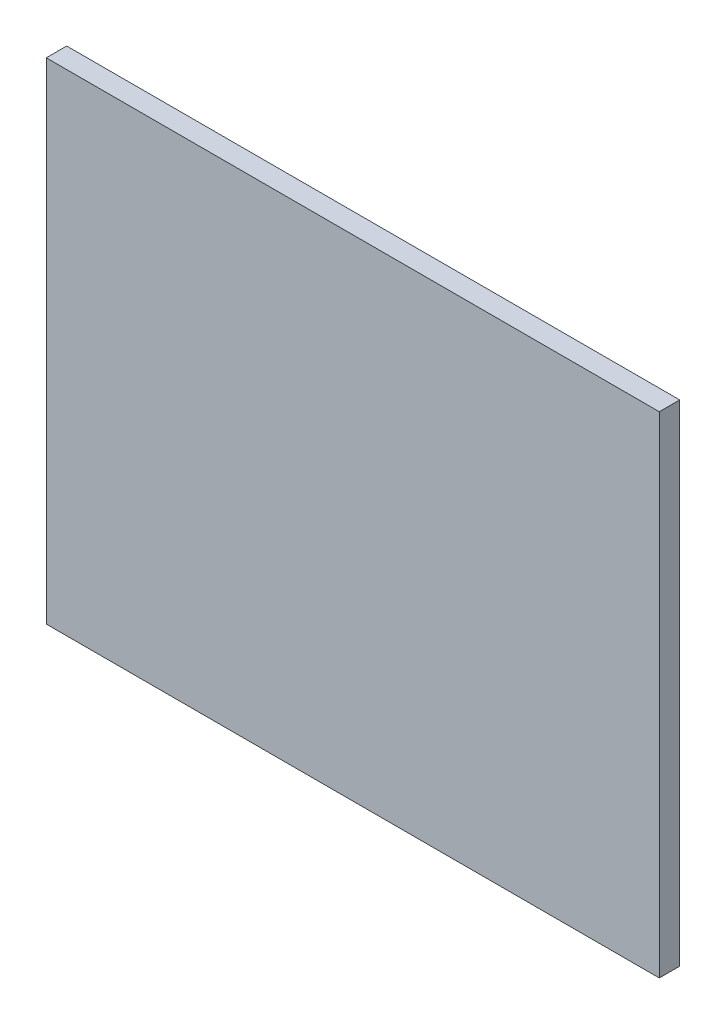
ISO-10303-21;
HEADER;
FILE_DESCRIPTION(('STEP AP214'),'2;1');
FILE_NAME('part.step','',(''),(''),'','','');
FILE_SCHEMA(('AUTOMOTIVE_DESIGN { 1 0 10303 214 1 1 1 1 }'));
ENDSEC;
DATA;
#1=APPLICATION_CONTEXT('core data for automotive mechanical design processes');
#2=APPLICATION_PROTOCOL_DEFINITION('international standard','automotive_design',2000,#1);
#3=PRODUCT_CONTEXT('',#1,'mechanical');
#4=PRODUCT('Part','Part','',(#3));
#5=PRODUCT_RELATED_PRODUCT_CATEGORY('part','',(#4));
#6=PRODUCT_DEFINITION_FORMATION('','',#4);
#7=PRODUCT_DEFINITION_CONTEXT('part definition',#1,'design');
#8=PRODUCT_DEFINITION('design','',#6,#7);
#9=PRODUCT_DEFINITION_SHAPE('','',#8);
#10=(LENGTH_UNIT() NAMED_UNIT(*) SI_UNIT(.MILLI.,.METRE.));
#11=(NAMED_UNIT(*) PLANE_ANGLE_UNIT() SI_UNIT($,.RADIAN.));
#12=(NAMED_UNIT(*) SI_UNIT($,.STERADIAN.) SOLID_ANGLE_UNIT());
#13=UNCERTAINTY_MEASURE_WITH_UNIT(LENGTH_MEASURE(1.E-05),#10,'distance_accuracy_value','');
#14=(GEOMETRIC_REPRESENTATION_CONTEXT(3) GLOBAL_UNCERTAINTY_ASSIGNED_CONTEXT((#13)) GLOBAL_UNIT_ASSIGNED_CONTEXT((#10,
#11,#12)) REPRESENTATION_CONTEXT('',''));
#15=CARTESIAN_POINT('',(0.,0.,0.));
#16=DIRECTION('',(0.,0.,1.));
#17=DIRECTION('',(1.,0.,0.));
#18=AXIS2_PLACEMENT_3D('',#15,#16,#17);
#19=CARTESIAN_POINT('',(0.,0.,12.7));
#20=DIRECTION('',(-1.,0.,0.));
#21=DIRECTION('',(0.,0.,1.));
#22=AXIS2_PLACEMENT_3D('',#19,#20,#21);
#23=PLANE('',#22);
#24=DIRECTION('',(0.,1.,0.));
#25=VECTOR('',#24,1.);
#26=CARTESIAN_POINT('',(0.,0.,0.));
#27=LINE('',#26,#25);
#28=CARTESIAN_POINT('',(0.,0.,0.));
#29=VERTEX_POINT('',#28);
#30=CARTESIAN_POINT('',(0.,304.8,0.));
#31=VERTEX_POINT('',#30);
#32=EDGE_CURVE('E98',#29,#31,#27,.T.);
#33=ORIENTED_EDGE('',*,*,#32,.T.);
#34=DIRECTION('',(0.,0.,-1.));
#35=VECTOR('',#34,1.);
#36=CARTESIAN_POINT('',(0.,304.8,12.7));
#37=LINE('',#36,#35);
#38=CARTESIAN_POINT('',(0.,304.8,12.7));
#39=VERTEX_POINT('',#38);
#40=EDGE_CURVE('E11',#39,#31,#37,.T.);
#41=ORIENTED_EDGE('',*,*,#40,.F.);
#42=DIRECTION('',(0.,1.,0.));
#43=VECTOR('',#42,1.);
#44=CARTESIAN_POINT('',(0.,0.,12.7));
#45=LINE('',#44,#43);
#46=CARTESIAN_POINT('',(0.,0.,12.7));
#47=VERTEX_POINT('',#46);
#48=EDGE_CURVE('E86',#47,#39,#45,.T.);
#49=ORIENTED_EDGE('',*,*,#48,.F.);
#50=DIRECTION('',(0.,0.,-1.));
#51=VECTOR('',#50,1.);
#52=CARTESIAN_POINT('',(0.,0.,12.7));
#53=LINE('',#52,#51);
#54=EDGE_CURVE('E94',#47,#29,#53,.T.);
#55=ORIENTED_EDGE('',*,*,#54,.T.);
#56=EDGE_LOOP('',(#33,#41,#49,#55));
#57=FACE_BOUND('',#56,.T.);
#58=ADVANCED_FACE('F35',(#57),#23,.F.);
#59=CARTESIAN_POINT('',(0.,304.8,12.7));
#60=DIRECTION('',(0.,-1.,0.));
#61=DIRECTION('',(1.,0.,0.));
#62=AXIS2_PLACEMENT_3D('',#59,#60,#61);
#63=PLANE('',#62);
#64=DIRECTION('',(-1.,0.,0.));
#65=VECTOR('',#64,1.);
#66=CARTESIAN_POINT('',(0.,304.8,0.));
#67=LINE('',#66,#65);
#68=CARTESIAN_POINT('',(-381.,304.8,0.));
#69=VERTEX_POINT('',#68);
#70=EDGE_CURVE('E90',#31,#69,#67,.T.);
#71=ORIENTED_EDGE('',*,*,#70,.T.);
#72=DIRECTION('',(0.,0.,-1.));
#73=VECTOR('',#72,1.);
#74=CARTESIAN_POINT('',(-381.,304.8,12.7));
#75=LINE('',#74,#73);
#76=CARTESIAN_POINT('',(-381.,304.8,12.7));
#77=VERTEX_POINT('',#76);
#78=EDGE_CURVE('E43',#77,#69,#75,.T.);
#79=ORIENTED_EDGE('',*,*,#78,.F.);
#80=DIRECTION('',(-1.,0.,0.));
#81=VECTOR('',#80,1.);
#82=CARTESIAN_POINT('',(0.,304.8,12.7));
#83=LINE('',#82,#81);
#84=EDGE_CURVE('E81',#39,#77,#83,.T.);
#85=ORIENTED_EDGE('',*,*,#84,.F.);
#86=ORIENTED_EDGE('',*,*,#40,.T.);
#87=EDGE_LOOP('',(#71,#79,#85,#86));
#88=FACE_BOUND('',#87,.T.);
#89=ADVANCED_FACE('F89',(#88),#63,.F.);
#90=CARTESIAN_POINT('',(-381.,0.,12.7));
#91=DIRECTION('',(1.,0.,0.));
#92=DIRECTION('',(0.,0.,-1.));
#93=AXIS2_PLACEMENT_3D('',#90,#91,#92);
#94=PLANE('',#93);
#95=DIRECTION('',(0.,-1.,0.));
#96=VECTOR('',#95,1.);
#97=CARTESIAN_POINT('',(-381.,0.,0.));
#98=LINE('',#97,#96);
#99=CARTESIAN_POINT('',(-381.,0.,0.));
#100=VERTEX_POINT('',#99);
#101=EDGE_CURVE('E68',#69,#100,#98,.T.);
#102=ORIENTED_EDGE('',*,*,#101,.T.);
#103=DIRECTION('',(0.,0.,-1.));
#104=VECTOR('',#103,1.);
#105=CARTESIAN_POINT('',(-381.,0.,12.7));
#106=LINE('',#105,#104);
#107=CARTESIAN_POINT('',(-381.,0.,12.7));
#108=VERTEX_POINT('',#107);
#109=EDGE_CURVE('E91',#108,#100,#106,.T.);
#110=ORIENTED_EDGE('',*,*,#109,.F.);
#111=DIRECTION('',(0.,-1.,0.));
#112=VECTOR('',#111,1.);
#113=CARTESIAN_POINT('',(-381.,0.,12.7));
#114=LINE('',#113,#112);
#115=EDGE_CURVE('E84',#77,#108,#114,.T.);
#116=ORIENTED_EDGE('',*,*,#115,.F.);
#117=ORIENTED_EDGE('',*,*,#78,.T.);
#118=EDGE_LOOP('',(#102,#110,#116,#117));
#119=FACE_BOUND('',#118,.T.);
#120=ADVANCED_FACE('F92',(#119),#94,.F.);
#121=CARTESIAN_POINT('',(0.,0.,12.7));
#122=DIRECTION('',(0.,1.,0.));
#123=DIRECTION('',(-1.,0.,0.));
#124=AXIS2_PLACEMENT_3D('',#121,#122,#123);
#125=PLANE('',#124);
#126=DIRECTION('',(1.,0.,0.));
#127=VECTOR('',#126,1.);
#128=CARTESIAN_POINT('',(0.,0.,0.));
#129=LINE('',#128,#127);
#130=EDGE_CURVE('E74',#100,#29,#129,.T.);
#131=ORIENTED_EDGE('',*,*,#130,.T.);
#132=ORIENTED_EDGE('',*,*,#54,.F.);
#133=DIRECTION('',(1.,0.,0.));
#134=VECTOR('',#133,1.);
#135=CARTESIAN_POINT('',(0.,0.,12.7));
#136=LINE('',#135,#134);
#137=EDGE_CURVE('E51',#108,#47,#136,.T.);
#138=ORIENTED_EDGE('',*,*,#137,.F.);
#139=ORIENTED_EDGE('',*,*,#109,.T.);
#140=EDGE_LOOP('',(#131,#132,#138,#139));
#141=FACE_BOUND('',#140,.T.);
#142=ADVANCED_FACE('F105',(#141),#125,.F.);
#143=CARTESIAN_POINT('',(0.,304.8,12.7));
#144=DIRECTION('',(0.,0.,1.));
#145=DIRECTION('',(1.,0.,0.));
#146=AXIS2_PLACEMENT_3D('',#143,#144,#145);
#147=PLANE('',#146);
#148=ORIENTED_EDGE('',*,*,#48,.T.);
#149=ORIENTED_EDGE('',*,*,#84,.T.);
#150=ORIENTED_EDGE('',*,*,#115,.T.);
#151=ORIENTED_EDGE('',*,*,#137,.T.);
#152=EDGE_LOOP('',(#148,#149,#150,#151));
#153=FACE_BOUND('',#152,.T.);
#154=ADVANCED_FACE('F82',(#153),#147,.T.);
#155=CARTESIAN_POINT('',(0.,304.8,0.));
#156=DIRECTION('',(0.,0.,1.));
#157=DIRECTION('',(1.,0.,0.));
#158=AXIS2_PLACEMENT_3D('',#155,#156,#157);
#159=PLANE('',#158);
#160=ORIENTED_EDGE('',*,*,#32,.F.);
#161=ORIENTED_EDGE('',*,*,#130,.F.);
#162=ORIENTED_EDGE('',*,*,#101,.F.);
#163=ORIENTED_EDGE('',*,*,#70,.F.);
#164=EDGE_LOOP('',(#160,#161,#162,#163));
#165=FACE_BOUND('',#164,.T.);
#166=ADVANCED_FACE('F108',(#165),#159,.F.);
#167=CLOSED_SHELL('',(#58,#89,#120,#142,#154,#166));
#168=MANIFOLD_SOLID_BREP('B2',#167);
#169=ADVANCED_BREP_SHAPE_REPRESENTATION('',(#18,#168),#14);
#170=SHAPE_DEFINITION_REPRESENTATION(#9,#169);
ENDSEC;
END-ISO-10303-21;
